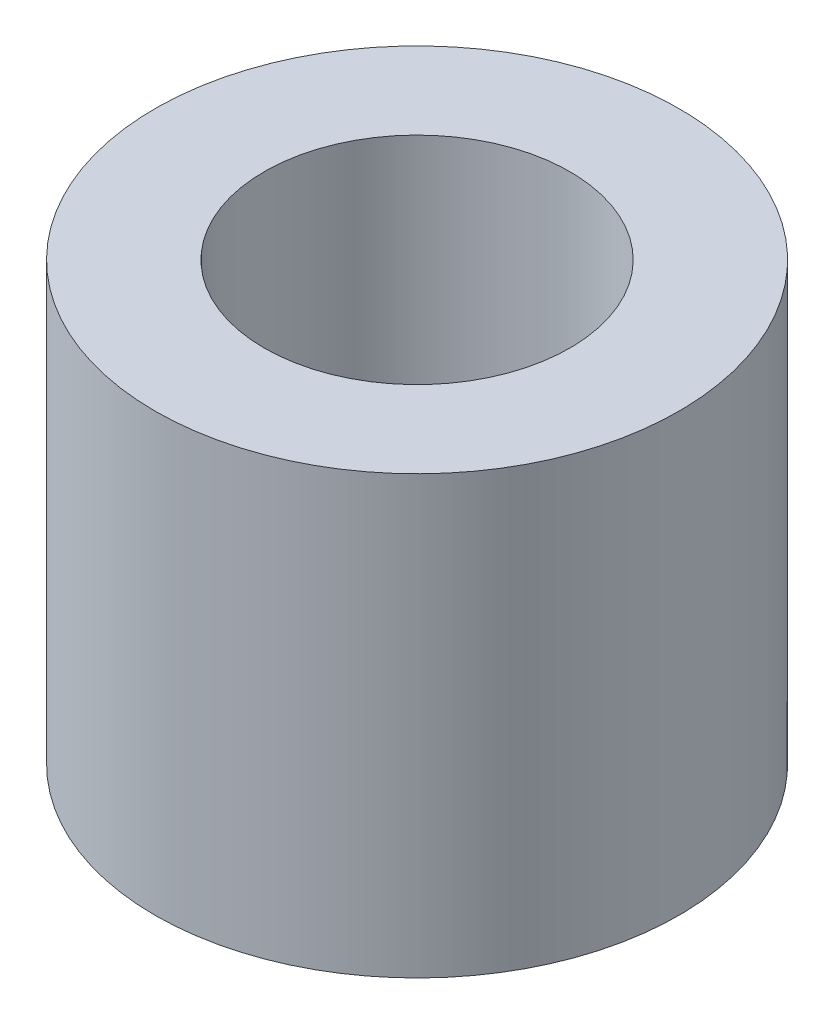
ISO-10303-21;
HEADER;
FILE_DESCRIPTION(('STEP AP214'),'2;1');
FILE_NAME('part.step','',(''),(''),'','','');
FILE_SCHEMA(('AUTOMOTIVE_DESIGN { 1 0 10303 214 1 1 1 1 }'));
ENDSEC;
DATA;
#1=APPLICATION_CONTEXT('core data for automotive mechanical design processes');
#2=APPLICATION_PROTOCOL_DEFINITION('international standard','automotive_design',2000,#1);
#3=PRODUCT_CONTEXT('',#1,'mechanical');
#4=PRODUCT('Part','Part','',(#3));
#5=PRODUCT_RELATED_PRODUCT_CATEGORY('part','',(#4));
#6=PRODUCT_DEFINITION_FORMATION('','',#4);
#7=PRODUCT_DEFINITION_CONTEXT('part definition',#1,'design');
#8=PRODUCT_DEFINITION('design','',#6,#7);
#9=PRODUCT_DEFINITION_SHAPE('','',#8);
#10=(LENGTH_UNIT() NAMED_UNIT(*) SI_UNIT(.MILLI.,.METRE.));
#11=(NAMED_UNIT(*) PLANE_ANGLE_UNIT() SI_UNIT($,.RADIAN.));
#12=(NAMED_UNIT(*) SI_UNIT($,.STERADIAN.) SOLID_ANGLE_UNIT());
#13=UNCERTAINTY_MEASURE_WITH_UNIT(LENGTH_MEASURE(1.E-05),#10,'distance_accuracy_value','');
#14=(GEOMETRIC_REPRESENTATION_CONTEXT(3) GLOBAL_UNCERTAINTY_ASSIGNED_CONTEXT((#13)) GLOBAL_UNIT_ASSIGNED_CONTEXT((#10,
#11,#12)) REPRESENTATION_CONTEXT('',''));
#15=CARTESIAN_POINT('',(0.,0.,0.));
#16=DIRECTION('',(0.,0.,1.));
#17=DIRECTION('',(1.,0.,0.));
#18=AXIS2_PLACEMENT_3D('',#15,#16,#17);
#19=CARTESIAN_POINT('',(0.,5.,0.));
#20=DIRECTION('',(0.,1.,0.));
#21=DIRECTION('',(0.,0.,1.));
#22=AXIS2_PLACEMENT_3D('',#19,#20,#21);
#23=PLANE('',#22);
#24=CARTESIAN_POINT('',(0.,5.,0.));
#25=DIRECTION('',(0.,1.,0.));
#26=DIRECTION('',(0.,0.,1.));
#27=AXIS2_PLACEMENT_3D('',#24,#25,#26);
#28=CIRCLE('',#27,3.);
#29=CARTESIAN_POINT('',(0.,5.,3.));
#30=VERTEX_POINT('',#29);
#31=EDGE_CURVE('E10',#30,#30,#28,.T.);
#32=ORIENTED_EDGE('',*,*,#31,.T.);
#33=EDGE_LOOP('',(#32));
#34=FACE_BOUND('',#33,.T.);
#35=CARTESIAN_POINT('',(0.,5.,0.));
#36=DIRECTION('',(0.,1.,0.));
#37=DIRECTION('',(0.,0.,1.));
#38=AXIS2_PLACEMENT_3D('',#35,#36,#37);
#39=CIRCLE('',#38,1.75);
#40=CARTESIAN_POINT('',(0.,5.,1.75));
#41=VERTEX_POINT('',#40);
#42=EDGE_CURVE('E56',#41,#41,#39,.T.);
#43=ORIENTED_EDGE('',*,*,#42,.F.);
#44=EDGE_LOOP('',(#43));
#45=FACE_BOUND('',#44,.T.);
#46=ADVANCED_FACE('F43',(#34,#45),#23,.T.);
#47=CARTESIAN_POINT('',(0.,0.,0.));
#48=DIRECTION('',(0.,1.,0.));
#49=DIRECTION('',(0.,0.,1.));
#50=AXIS2_PLACEMENT_3D('',#47,#48,#49);
#51=PLANE('',#50);
#52=CARTESIAN_POINT('',(0.,0.,0.));
#53=DIRECTION('',(0.,1.,0.));
#54=DIRECTION('',(0.,0.,1.));
#55=AXIS2_PLACEMENT_3D('',#52,#53,#54);
#56=CIRCLE('',#55,3.);
#57=CARTESIAN_POINT('',(0.,0.,3.));
#58=VERTEX_POINT('',#57);
#59=EDGE_CURVE('E47',#58,#58,#56,.T.);
#60=ORIENTED_EDGE('',*,*,#59,.F.);
#61=EDGE_LOOP('',(#60));
#62=FACE_BOUND('',#61,.T.);
#63=CARTESIAN_POINT('',(0.,0.,0.));
#64=DIRECTION('',(0.,1.,0.));
#65=DIRECTION('',(0.,0.,1.));
#66=AXIS2_PLACEMENT_3D('',#63,#64,#65);
#67=CIRCLE('',#66,1.75);
#68=CARTESIAN_POINT('',(0.,0.,1.75));
#69=VERTEX_POINT('',#68);
#70=EDGE_CURVE('E58',#69,#69,#67,.T.);
#71=ORIENTED_EDGE('',*,*,#70,.T.);
#72=EDGE_LOOP('',(#71));
#73=FACE_BOUND('',#72,.T.);
#74=ADVANCED_FACE('F70',(#62,#73),#51,.F.);
#75=CARTESIAN_POINT('',(0.,5.,0.));
#76=DIRECTION('',(0.,-1.,0.));
#77=DIRECTION('',(0.,0.,-1.));
#78=AXIS2_PLACEMENT_3D('',#75,#76,#77);
#79=CYLINDRICAL_SURFACE('',#78,3.);
#80=ORIENTED_EDGE('',*,*,#31,.F.);
#81=EDGE_LOOP('',(#80));
#82=FACE_BOUND('',#81,.T.);
#83=ORIENTED_EDGE('',*,*,#59,.T.);
#84=EDGE_LOOP('',(#83));
#85=FACE_BOUND('',#84,.T.);
#86=ADVANCED_FACE('F45',(#82,#85),#79,.T.);
#87=CARTESIAN_POINT('',(0.,5.,0.));
#88=DIRECTION('',(0.,-1.,0.));
#89=DIRECTION('',(0.,0.,-1.));
#90=AXIS2_PLACEMENT_3D('',#87,#88,#89);
#91=CYLINDRICAL_SURFACE('',#90,1.75);
#92=ORIENTED_EDGE('',*,*,#42,.T.);
#93=EDGE_LOOP('',(#92));
#94=FACE_BOUND('',#93,.T.);
#95=ORIENTED_EDGE('',*,*,#70,.F.);
#96=EDGE_LOOP('',(#95));
#97=FACE_BOUND('',#96,.T.);
#98=ADVANCED_FACE('F66',(#94,#97),#91,.F.);
#99=CLOSED_SHELL('',(#46,#74,#86,#98));
#100=MANIFOLD_SOLID_BREP('B2',#99);
#101=ADVANCED_BREP_SHAPE_REPRESENTATION('',(#18,#100),#14);
#102=SHAPE_DEFINITION_REPRESENTATION(#9,#101);
ENDSEC;
END-ISO-10303-21;
